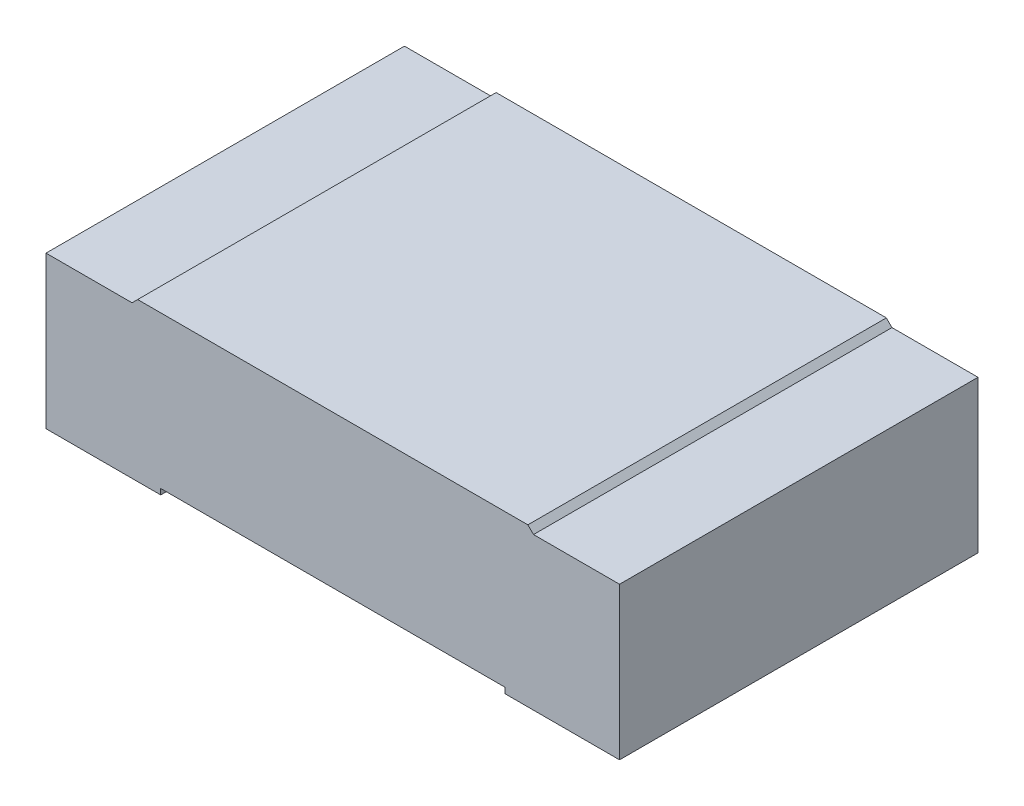
ISO-10303-21;
HEADER;
FILE_DESCRIPTION(('STEP AP214'),'2;1');
FILE_NAME('part.step','',(''),(''),'','','');
FILE_SCHEMA(('AUTOMOTIVE_DESIGN { 1 0 10303 214 1 1 1 1 }'));
ENDSEC;
DATA;
#1=APPLICATION_CONTEXT('core data for automotive mechanical design processes');
#2=APPLICATION_PROTOCOL_DEFINITION('international standard','automotive_design',2000,#1);
#3=PRODUCT_CONTEXT('',#1,'mechanical');
#4=PRODUCT('Part','Part','',(#3));
#5=PRODUCT_RELATED_PRODUCT_CATEGORY('part','',(#4));
#6=PRODUCT_DEFINITION_FORMATION('','',#4);
#7=PRODUCT_DEFINITION_CONTEXT('part definition',#1,'design');
#8=PRODUCT_DEFINITION('design','',#6,#7);
#9=PRODUCT_DEFINITION_SHAPE('','',#8);
#10=(LENGTH_UNIT() NAMED_UNIT(*) SI_UNIT(.MILLI.,.METRE.));
#11=(NAMED_UNIT(*) PLANE_ANGLE_UNIT() SI_UNIT($,.RADIAN.));
#12=(NAMED_UNIT(*) SI_UNIT($,.STERADIAN.) SOLID_ANGLE_UNIT());
#13=UNCERTAINTY_MEASURE_WITH_UNIT(LENGTH_MEASURE(1.E-05),#10,'distance_accuracy_value','');
#14=(GEOMETRIC_REPRESENTATION_CONTEXT(3) GLOBAL_UNCERTAINTY_ASSIGNED_CONTEXT((#13)) GLOBAL_UNIT_ASSIGNED_CONTEXT((#10,
#11,#12)) REPRESENTATION_CONTEXT('',''));
#15=CARTESIAN_POINT('',(0.,0.,0.));
#16=DIRECTION('',(0.,0.,1.));
#17=DIRECTION('',(1.,0.,0.));
#18=AXIS2_PLACEMENT_3D('',#15,#16,#17);
#19=CARTESIAN_POINT('',(0.,0.,0.));
#20=DIRECTION('',(0.,1.,0.));
#21=DIRECTION('',(0.,0.,1.));
#22=AXIS2_PLACEMENT_3D('',#19,#20,#21);
#23=PLANE('',#22);
#24=DIRECTION('',(0.,0.,-1.));
#25=VECTOR('',#24,1.);
#26=CARTESIAN_POINT('',(1.,0.,0.625));
#27=LINE('',#26,#25);
#28=CARTESIAN_POINT('',(1.,0.,0.625));
#29=VERTEX_POINT('',#28);
#30=CARTESIAN_POINT('',(1.,0.,-0.625));
#31=VERTEX_POINT('',#30);
#32=EDGE_CURVE('E19',#29,#31,#27,.T.);
#33=ORIENTED_EDGE('',*,*,#32,.F.);
#34=DIRECTION('',(1.,0.,0.));
#35=VECTOR('',#34,1.);
#36=CARTESIAN_POINT('',(-1.,0.,0.625));
#37=LINE('',#36,#35);
#38=CARTESIAN_POINT('',(0.6,0.,0.625));
#39=VERTEX_POINT('',#38);
#40=EDGE_CURVE('E409',#39,#29,#37,.T.);
#41=ORIENTED_EDGE('',*,*,#40,.F.);
#42=DIRECTION('',(0.,0.,-1.));
#43=VECTOR('',#42,1.);
#44=CARTESIAN_POINT('',(0.6,0.,0.625));
#45=LINE('',#44,#43);
#46=CARTESIAN_POINT('',(0.6,0.,-0.625));
#47=VERTEX_POINT('',#46);
#48=EDGE_CURVE('E116',#39,#47,#45,.T.);
#49=ORIENTED_EDGE('',*,*,#48,.T.);
#50=DIRECTION('',(-1.,0.,0.));
#51=VECTOR('',#50,1.);
#52=CARTESIAN_POINT('',(1.,0.,-0.625));
#53=LINE('',#52,#51);
#54=EDGE_CURVE('E174',#31,#47,#53,.T.);
#55=ORIENTED_EDGE('',*,*,#54,.F.);
#56=EDGE_LOOP('',(#33,#41,#49,#55));
#57=FACE_BOUND('',#56,.T.);
#58=ADVANCED_FACE('F16',(#57),#23,.F.);
#59=CARTESIAN_POINT('',(1.,0.,0.625));
#60=DIRECTION('',(1.,0.,0.));
#61=DIRECTION('',(0.,0.,-1.));
#62=AXIS2_PLACEMENT_3D('',#59,#60,#61);
#63=PLANE('',#62);
#64=DIRECTION('',(0.,1.,0.));
#65=VECTOR('',#64,1.);
#66=CARTESIAN_POINT('',(1.,0.,-0.625));
#67=LINE('',#66,#65);
#68=CARTESIAN_POINT('',(1.,0.5303970200055,-0.625));
#69=VERTEX_POINT('',#68);
#70=EDGE_CURVE('E168',#69,#31,#67,.F.);
#71=ORIENTED_EDGE('',*,*,#70,.F.);
#72=DIRECTION('',(0.,0.,-1.));
#73=VECTOR('',#72,1.);
#74=CARTESIAN_POINT('',(1.,0.5303970200055,0.625));
#75=LINE('',#74,#73);
#76=CARTESIAN_POINT('',(1.,0.5303970200055,0.625));
#77=VERTEX_POINT('',#76);
#78=EDGE_CURVE('E134',#69,#77,#75,.F.);
#79=ORIENTED_EDGE('',*,*,#78,.T.);
#80=DIRECTION('',(0.,1.,0.));
#81=VECTOR('',#80,1.);
#82=CARTESIAN_POINT('',(1.,0.,0.625));
#83=LINE('',#82,#81);
#84=EDGE_CURVE('E171',#29,#77,#83,.T.);
#85=ORIENTED_EDGE('',*,*,#84,.F.);
#86=ORIENTED_EDGE('',*,*,#32,.T.);
#87=EDGE_LOOP('',(#71,#79,#85,#86));
#88=FACE_BOUND('',#87,.T.);
#89=ADVANCED_FACE('F166',(#88),#63,.T.);
#90=CARTESIAN_POINT('',(-1.,0.5303970200055,0.625));
#91=DIRECTION('',(0.,-1.,0.));
#92=DIRECTION('',(0.,0.,-1.));
#93=AXIS2_PLACEMENT_3D('',#90,#91,#92);
#94=PLANE('',#93);
#95=DIRECTION('',(0.,0.,1.));
#96=VECTOR('',#95,1.);
#97=CARTESIAN_POINT('',(-0.7,0.5303970200055,0.625));
#98=LINE('',#97,#96);
#99=CARTESIAN_POINT('',(-0.7,0.5303970200055,0.625));
#100=VERTEX_POINT('',#99);
#101=CARTESIAN_POINT('',(-0.7,0.5303970200055,-0.625));
#102=VERTEX_POINT('',#101);
#103=EDGE_CURVE('E414',#100,#102,#98,.F.);
#104=ORIENTED_EDGE('',*,*,#103,.T.);
#105=DIRECTION('',(-1.,0.,0.));
#106=VECTOR('',#105,1.);
#107=CARTESIAN_POINT('',(1.,0.5303970200055,-0.625));
#108=LINE('',#107,#106);
#109=CARTESIAN_POINT('',(-1.,0.5303970200055,-0.625));
#110=VERTEX_POINT('',#109);
#111=EDGE_CURVE('E182',#110,#102,#108,.F.);
#112=ORIENTED_EDGE('',*,*,#111,.F.);
#113=DIRECTION('',(0.,0.,1.));
#114=VECTOR('',#113,1.);
#115=CARTESIAN_POINT('',(-1.,0.5303970200055,-0.625));
#116=LINE('',#115,#114);
#117=CARTESIAN_POINT('',(-1.,0.5303970200055,0.625));
#118=VERTEX_POINT('',#117);
#119=EDGE_CURVE('E151',#118,#110,#116,.F.);
#120=ORIENTED_EDGE('',*,*,#119,.F.);
#121=DIRECTION('',(1.,0.,0.));
#122=VECTOR('',#121,1.);
#123=CARTESIAN_POINT('',(-1.,0.5303970200055,0.625));
#124=LINE('',#123,#122);
#125=EDGE_CURVE('E398',#100,#118,#124,.F.);
#126=ORIENTED_EDGE('',*,*,#125,.F.);
#127=EDGE_LOOP('',(#104,#112,#120,#126));
#128=FACE_BOUND('',#127,.T.);
#129=ADVANCED_FACE('F203',(#128),#94,.F.);
#130=CARTESIAN_POINT('',(-1.,0.,-0.625));
#131=DIRECTION('',(-1.,0.,0.));
#132=DIRECTION('',(0.,0.,1.));
#133=AXIS2_PLACEMENT_3D('',#130,#131,#132);
#134=PLANE('',#133);
#135=DIRECTION('',(0.,1.,0.));
#136=VECTOR('',#135,1.);
#137=CARTESIAN_POINT('',(-1.,0.,0.625));
#138=LINE('',#137,#136);
#139=CARTESIAN_POINT('',(-1.,0.,0.625));
#140=VERTEX_POINT('',#139);
#141=EDGE_CURVE('E200',#118,#140,#138,.F.);
#142=ORIENTED_EDGE('',*,*,#141,.F.);
#143=ORIENTED_EDGE('',*,*,#119,.T.);
#144=DIRECTION('',(0.,1.,0.));
#145=VECTOR('',#144,1.);
#146=CARTESIAN_POINT('',(-1.,0.,-0.625));
#147=LINE('',#146,#145);
#148=CARTESIAN_POINT('',(-1.,0.,-0.625));
#149=VERTEX_POINT('',#148);
#150=EDGE_CURVE('E189',#149,#110,#147,.T.);
#151=ORIENTED_EDGE('',*,*,#150,.F.);
#152=DIRECTION('',(0.,0.,1.));
#153=VECTOR('',#152,1.);
#154=CARTESIAN_POINT('',(-1.,0.,0.));
#155=LINE('',#154,#153);
#156=EDGE_CURVE('E149',#149,#140,#155,.T.);
#157=ORIENTED_EDGE('',*,*,#156,.T.);
#158=EDGE_LOOP('',(#142,#143,#151,#157));
#159=FACE_BOUND('',#158,.T.);
#160=ADVANCED_FACE('F199',(#159),#134,.T.);
#161=CARTESIAN_POINT('',(0.,0.,0.));
#162=DIRECTION('',(0.,1.,0.));
#163=DIRECTION('',(0.,0.,1.));
#164=AXIS2_PLACEMENT_3D('',#161,#162,#163);
#165=PLANE('',#164);
#166=ORIENTED_EDGE('',*,*,#156,.F.);
#167=DIRECTION('',(-1.,0.,0.));
#168=VECTOR('',#167,1.);
#169=CARTESIAN_POINT('',(1.,0.,-0.625));
#170=LINE('',#169,#168);
#171=CARTESIAN_POINT('',(-0.6,0.,-0.625));
#172=VERTEX_POINT('',#171);
#173=EDGE_CURVE('E126',#172,#149,#170,.T.);
#174=ORIENTED_EDGE('',*,*,#173,.F.);
#175=DIRECTION('',(0.,0.,1.));
#176=VECTOR('',#175,1.);
#177=CARTESIAN_POINT('',(-0.6,0.,0.625));
#178=LINE('',#177,#176);
#179=CARTESIAN_POINT('',(-0.6,0.,0.625));
#180=VERTEX_POINT('',#179);
#181=EDGE_CURVE('E117',#172,#180,#178,.T.);
#182=ORIENTED_EDGE('',*,*,#181,.T.);
#183=DIRECTION('',(1.,0.,0.));
#184=VECTOR('',#183,1.);
#185=CARTESIAN_POINT('',(-1.,0.,0.625));
#186=LINE('',#185,#184);
#187=EDGE_CURVE('E197',#140,#180,#186,.T.);
#188=ORIENTED_EDGE('',*,*,#187,.F.);
#189=EDGE_LOOP('',(#166,#174,#182,#188));
#190=FACE_BOUND('',#189,.T.);
#191=ADVANCED_FACE('F194',(#190),#165,.F.);
#192=CARTESIAN_POINT('',(-0.6,0.01960297999455,0.625));
#193=DIRECTION('',(-1.,0.,0.));
#194=DIRECTION('',(0.,0.,1.));
#195=AXIS2_PLACEMENT_3D('',#192,#193,#194);
#196=PLANE('',#195);
#197=DIRECTION('',(0.,0.,1.));
#198=VECTOR('',#197,1.);
#199=CARTESIAN_POINT('',(-0.6,0.01960297999455,0.625));
#200=LINE('',#199,#198);
#201=CARTESIAN_POINT('',(-0.6,0.01960297999455,-0.625));
#202=VERTEX_POINT('',#201);
#203=CARTESIAN_POINT('',(-0.6,0.01960297999455,0.625));
#204=VERTEX_POINT('',#203);
#205=EDGE_CURVE('E107',#202,#204,#200,.T.);
#206=ORIENTED_EDGE('',*,*,#205,.T.);
#207=DIRECTION('',(0.,1.,0.));
#208=VECTOR('',#207,1.);
#209=CARTESIAN_POINT('',(-0.6,0.,0.625));
#210=LINE('',#209,#208);
#211=EDGE_CURVE('E387',#180,#204,#210,.T.);
#212=ORIENTED_EDGE('',*,*,#211,.F.);
#213=ORIENTED_EDGE('',*,*,#181,.F.);
#214=DIRECTION('',(0.,1.,0.));
#215=VECTOR('',#214,1.);
#216=CARTESIAN_POINT('',(-0.6,0.,-0.625));
#217=LINE('',#216,#215);
#218=EDGE_CURVE('E120',#202,#172,#217,.F.);
#219=ORIENTED_EDGE('',*,*,#218,.F.);
#220=EDGE_LOOP('',(#206,#212,#213,#219));
#221=FACE_BOUND('',#220,.T.);
#222=ADVANCED_FACE('F121',(#221),#196,.F.);
#223=CARTESIAN_POINT('',(0.6,0.01960297999455,0.625));
#224=DIRECTION('',(0.,1.,0.));
#225=DIRECTION('',(0.,0.,1.));
#226=AXIS2_PLACEMENT_3D('',#223,#224,#225);
#227=PLANE('',#226);
#228=DIRECTION('',(-1.,0.,0.));
#229=VECTOR('',#228,1.);
#230=CARTESIAN_POINT('',(1.,0.01960297999455,-0.625));
#231=LINE('',#230,#229);
#232=CARTESIAN_POINT('',(0.6,0.01960297999455,-0.625));
#233=VERTEX_POINT('',#232);
#234=EDGE_CURVE('E104',#233,#202,#231,.T.);
#235=ORIENTED_EDGE('',*,*,#234,.F.);
#236=DIRECTION('',(0.,0.,-1.));
#237=VECTOR('',#236,1.);
#238=CARTESIAN_POINT('',(0.6,0.01960297999455,0.625));
#239=LINE('',#238,#237);
#240=CARTESIAN_POINT('',(0.6,0.01960297999455,0.625));
#241=VERTEX_POINT('',#240);
#242=EDGE_CURVE('E139',#233,#241,#239,.F.);
#243=ORIENTED_EDGE('',*,*,#242,.T.);
#244=DIRECTION('',(1.,0.,0.));
#245=VECTOR('',#244,1.);
#246=CARTESIAN_POINT('',(-1.,0.01960297999455,0.625));
#247=LINE('',#246,#245);
#248=EDGE_CURVE('E111',#204,#241,#247,.T.);
#249=ORIENTED_EDGE('',*,*,#248,.F.);
#250=ORIENTED_EDGE('',*,*,#205,.F.);
#251=EDGE_LOOP('',(#235,#243,#249,#250));
#252=FACE_BOUND('',#251,.T.);
#253=ADVANCED_FACE('F109',(#252),#227,.F.);
#254=CARTESIAN_POINT('',(0.6,0.,0.625));
#255=DIRECTION('',(1.,0.,0.));
#256=DIRECTION('',(0.,0.,-1.));
#257=AXIS2_PLACEMENT_3D('',#254,#255,#256);
#258=PLANE('',#257);
#259=ORIENTED_EDGE('',*,*,#242,.F.);
#260=DIRECTION('',(0.,1.,0.));
#261=VECTOR('',#260,1.);
#262=CARTESIAN_POINT('',(0.6,0.,-0.625));
#263=LINE('',#262,#261);
#264=EDGE_CURVE('E132',#47,#233,#263,.T.);
#265=ORIENTED_EDGE('',*,*,#264,.F.);
#266=ORIENTED_EDGE('',*,*,#48,.F.);
#267=DIRECTION('',(0.,1.,0.));
#268=VECTOR('',#267,1.);
#269=CARTESIAN_POINT('',(0.6,0.,0.625));
#270=LINE('',#269,#268);
#271=EDGE_CURVE('E383',#241,#39,#270,.F.);
#272=ORIENTED_EDGE('',*,*,#271,.F.);
#273=EDGE_LOOP('',(#259,#265,#266,#272));
#274=FACE_BOUND('',#273,.T.);
#275=ADVANCED_FACE('F237',(#274),#258,.F.);
#276=CARTESIAN_POINT('',(0.7,0.5303970200055,0.625));
#277=DIRECTION('',(0.,-1.,0.));
#278=DIRECTION('',(0.,0.,-1.));
#279=AXIS2_PLACEMENT_3D('',#276,#277,#278);
#280=PLANE('',#279);
#281=DIRECTION('',(-1.,0.,0.));
#282=VECTOR('',#281,1.);
#283=CARTESIAN_POINT('',(1.,0.5303970200055,-0.625));
#284=LINE('',#283,#282);
#285=CARTESIAN_POINT('',(0.7,0.5303970200055,-0.625));
#286=VERTEX_POINT('',#285);
#287=EDGE_CURVE('E179',#286,#69,#284,.F.);
#288=ORIENTED_EDGE('',*,*,#287,.F.);
#289=DIRECTION('',(0.,0.,1.));
#290=VECTOR('',#289,1.);
#291=CARTESIAN_POINT('',(0.7,0.5303970200055,0.625));
#292=LINE('',#291,#290);
#293=CARTESIAN_POINT('',(0.7,0.5303970200055,0.625));
#294=VERTEX_POINT('',#293);
#295=EDGE_CURVE('E420',#286,#294,#292,.T.);
#296=ORIENTED_EDGE('',*,*,#295,.T.);
#297=DIRECTION('',(1.,0.,0.));
#298=VECTOR('',#297,1.);
#299=CARTESIAN_POINT('',(-1.,0.5303970200055,0.625));
#300=LINE('',#299,#298);
#301=EDGE_CURVE('E404',#77,#294,#300,.F.);
#302=ORIENTED_EDGE('',*,*,#301,.F.);
#303=ORIENTED_EDGE('',*,*,#78,.F.);
#304=EDGE_LOOP('',(#288,#296,#302,#303));
#305=FACE_BOUND('',#304,.T.);
#306=ADVANCED_FACE('F234',(#305),#280,.F.);
#307=CARTESIAN_POINT('',(1.,0.,-0.625));
#308=DIRECTION('',(0.,0.,-1.));
#309=DIRECTION('',(-1.,0.,0.));
#310=AXIS2_PLACEMENT_3D('',#307,#308,#309);
#311=PLANE('',#310);
#312=ORIENTED_EDGE('',*,*,#54,.T.);
#313=ORIENTED_EDGE('',*,*,#264,.T.);
#314=ORIENTED_EDGE('',*,*,#234,.T.);
#315=ORIENTED_EDGE('',*,*,#218,.T.);
#316=ORIENTED_EDGE('',*,*,#173,.T.);
#317=ORIENTED_EDGE('',*,*,#150,.T.);
#318=ORIENTED_EDGE('',*,*,#111,.T.);
#319=DIRECTION('',(0.707106781186548,0.707106781186548,0.));
#320=VECTOR('',#319,1.);
#321=CARTESIAN_POINT('',(-0.7,0.5303970200055,-0.625));
#322=LINE('',#321,#320);
#323=CARTESIAN_POINT('',(-0.680397020005412,0.550000000000012,-0.625));
#324=VERTEX_POINT('',#323);
#325=EDGE_CURVE('E411',#102,#324,#322,.T.);
#326=ORIENTED_EDGE('',*,*,#325,.T.);
#327=DIRECTION('',(1.,0.,0.));
#328=VECTOR('',#327,1.);
#329=CARTESIAN_POINT('',(0.,0.55,-0.625));
#330=LINE('',#329,#328);
#331=CARTESIAN_POINT('',(0.6803970200055,0.55,-0.625));
#332=VERTEX_POINT('',#331);
#333=EDGE_CURVE('E424',#332,#324,#330,.F.);
#334=ORIENTED_EDGE('',*,*,#333,.F.);
#335=DIRECTION('',(0.707106781186548,-0.707106781186548,0.));
#336=VECTOR('',#335,1.);
#337=CARTESIAN_POINT('',(0.6803970200055,0.55,-0.625));
#338=LINE('',#337,#336);
#339=EDGE_CURVE('E385',#332,#286,#338,.T.);
#340=ORIENTED_EDGE('',*,*,#339,.T.);
#341=ORIENTED_EDGE('',*,*,#287,.T.);
#342=ORIENTED_EDGE('',*,*,#70,.T.);
#343=EDGE_LOOP('',(#312,#313,#314,#315,#316,#317,#318,#326,#334,#340,#341,#342));
#344=FACE_BOUND('',#343,.T.);
#345=ADVANCED_FACE('F130',(#344),#311,.T.);
#346=CARTESIAN_POINT('',(-0.7,0.5303970200055,0.625));
#347=DIRECTION('',(0.707106781186548,-0.707106781186548,0.));
#348=DIRECTION('',(0.707106781186548,0.707106781186548,0.));
#349=AXIS2_PLACEMENT_3D('',#346,#347,#348);
#350=PLANE('',#349);
#351=ORIENTED_EDGE('',*,*,#103,.F.);
#352=DIRECTION('',(-0.70710678118835,-0.707106781184745,0.));
#353=VECTOR('',#352,1.);
#354=CARTESIAN_POINT('',(-0.6803970200054,0.55,0.625));
#355=LINE('',#354,#353);
#356=CARTESIAN_POINT('',(-0.680397020005425,0.550000000000025,0.625));
#357=VERTEX_POINT('',#356);
#358=EDGE_CURVE('E401',#357,#100,#355,.T.);
#359=ORIENTED_EDGE('',*,*,#358,.F.);
#360=DIRECTION('',(0.,0.,1.));
#361=VECTOR('',#360,1.);
#362=CARTESIAN_POINT('',(-0.6803970200054,0.55,0.));
#363=LINE('',#362,#361);
#364=EDGE_CURVE('E431',#324,#357,#363,.T.);
#365=ORIENTED_EDGE('',*,*,#364,.F.);
#366=ORIENTED_EDGE('',*,*,#325,.F.);
#367=EDGE_LOOP('',(#351,#359,#365,#366));
#368=FACE_BOUND('',#367,.T.);
#369=ADVANCED_FACE('F228',(#368),#350,.F.);
#370=CARTESIAN_POINT('',(-1.,0.,0.625));
#371=DIRECTION('',(0.,0.,1.));
#372=DIRECTION('',(1.,0.,0.));
#373=AXIS2_PLACEMENT_3D('',#370,#371,#372);
#374=PLANE('',#373);
#375=ORIENTED_EDGE('',*,*,#248,.T.);
#376=ORIENTED_EDGE('',*,*,#271,.T.);
#377=ORIENTED_EDGE('',*,*,#40,.T.);
#378=ORIENTED_EDGE('',*,*,#84,.T.);
#379=ORIENTED_EDGE('',*,*,#301,.T.);
#380=DIRECTION('',(0.707106781186548,-0.707106781186548,0.));
#381=VECTOR('',#380,1.);
#382=CARTESIAN_POINT('',(0.6803970200055,0.55,0.625));
#383=LINE('',#382,#381);
#384=CARTESIAN_POINT('',(0.6803970200055,0.55,0.625));
#385=VERTEX_POINT('',#384);
#386=EDGE_CURVE('E35',#294,#385,#383,.F.);
#387=ORIENTED_EDGE('',*,*,#386,.T.);
#388=DIRECTION('',(1.,0.,0.));
#389=VECTOR('',#388,1.);
#390=CARTESIAN_POINT('',(0.,0.55,0.625));
#391=LINE('',#390,#389);
#392=EDGE_CURVE('E26',#357,#385,#391,.T.);
#393=ORIENTED_EDGE('',*,*,#392,.F.);
#394=ORIENTED_EDGE('',*,*,#358,.T.);
#395=ORIENTED_EDGE('',*,*,#125,.T.);
#396=ORIENTED_EDGE('',*,*,#141,.T.);
#397=ORIENTED_EDGE('',*,*,#187,.T.);
#398=ORIENTED_EDGE('',*,*,#211,.T.);
#399=EDGE_LOOP('',(#375,#376,#377,#378,#379,#387,#393,#394,#395,#396,#397,#398));
#400=FACE_BOUND('',#399,.T.);
#401=ADVANCED_FACE('F221',(#400),#374,.T.);
#402=CARTESIAN_POINT('',(0.6803970200055,0.55,0.625));
#403=DIRECTION('',(-0.707106781186548,-0.707106781186548,0.));
#404=DIRECTION('',(0.707106781186548,-0.707106781186548,0.));
#405=AXIS2_PLACEMENT_3D('',#402,#403,#404);
#406=PLANE('',#405);
#407=ORIENTED_EDGE('',*,*,#295,.F.);
#408=ORIENTED_EDGE('',*,*,#339,.F.);
#409=DIRECTION('',(0.,0.,1.));
#410=VECTOR('',#409,1.);
#411=CARTESIAN_POINT('',(0.6803970200055,0.55,0.));
#412=LINE('',#411,#410);
#413=EDGE_CURVE('E11',#385,#332,#412,.F.);
#414=ORIENTED_EDGE('',*,*,#413,.F.);
#415=ORIENTED_EDGE('',*,*,#386,.F.);
#416=EDGE_LOOP('',(#407,#408,#414,#415));
#417=FACE_BOUND('',#416,.T.);
#418=ADVANCED_FACE('F215',(#417),#406,.F.);
#419=CARTESIAN_POINT('',(0.,0.55,0.));
#420=DIRECTION('',(0.,1.,0.));
#421=DIRECTION('',(0.,0.,1.));
#422=AXIS2_PLACEMENT_3D('',#419,#420,#421);
#423=PLANE('',#422);
#424=ORIENTED_EDGE('',*,*,#392,.T.);
#425=ORIENTED_EDGE('',*,*,#413,.T.);
#426=ORIENTED_EDGE('',*,*,#333,.T.);
#427=ORIENTED_EDGE('',*,*,#364,.T.);
#428=EDGE_LOOP('',(#424,#425,#426,#427));
#429=FACE_BOUND('',#428,.T.);
#430=ADVANCED_FACE('F213',(#429),#423,.T.);
#431=CLOSED_SHELL('',(#58,#89,#129,#160,#191,#222,#253,#275,#306,#345,#369,#401,#418,#430));
#432=MANIFOLD_SOLID_BREP('B1',#431);
#433=ADVANCED_BREP_SHAPE_REPRESENTATION('',(#18,#432),#14);
#434=SHAPE_DEFINITION_REPRESENTATION(#9,#433);
ENDSEC;
END-ISO-10303-21;
